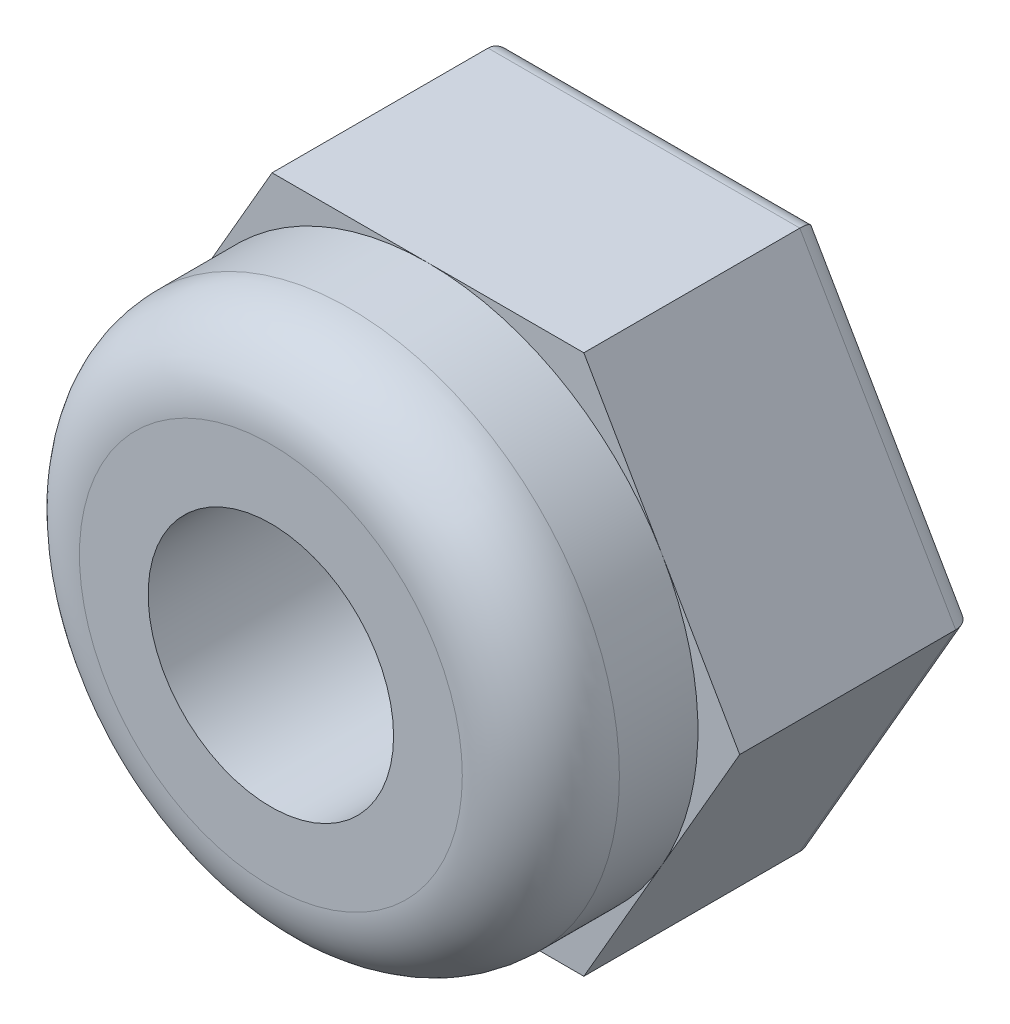
ISO-10303-21;
HEADER;
FILE_DESCRIPTION(('STEP AP214'),'2;1');
FILE_NAME('part.step','',(''),(''),'','','');
FILE_SCHEMA(('AUTOMOTIVE_DESIGN { 1 0 10303 214 1 1 1 1 }'));
ENDSEC;
DATA;
#1=APPLICATION_CONTEXT('core data for automotive mechanical design processes');
#2=APPLICATION_PROTOCOL_DEFINITION('international standard','automotive_design',2000,#1);
#3=PRODUCT_CONTEXT('',#1,'mechanical');
#4=PRODUCT('Part','Part','',(#3));
#5=PRODUCT_RELATED_PRODUCT_CATEGORY('part','',(#4));
#6=PRODUCT_DEFINITION_FORMATION('','',#4);
#7=PRODUCT_DEFINITION_CONTEXT('part definition',#1,'design');
#8=PRODUCT_DEFINITION('design','',#6,#7);
#9=PRODUCT_DEFINITION_SHAPE('','',#8);
#10=(LENGTH_UNIT() NAMED_UNIT(*) SI_UNIT(.MILLI.,.METRE.));
#11=(NAMED_UNIT(*) PLANE_ANGLE_UNIT() SI_UNIT($,.RADIAN.));
#12=(NAMED_UNIT(*) SI_UNIT($,.STERADIAN.) SOLID_ANGLE_UNIT());
#13=UNCERTAINTY_MEASURE_WITH_UNIT(LENGTH_MEASURE(1.E-05),#10,'distance_accuracy_value','');
#14=(GEOMETRIC_REPRESENTATION_CONTEXT(3) GLOBAL_UNCERTAINTY_ASSIGNED_CONTEXT((#13)) GLOBAL_UNIT_ASSIGNED_CONTEXT((#10,
#11,#12)) REPRESENTATION_CONTEXT('',''));
#15=CARTESIAN_POINT('',(0.,0.,0.));
#16=DIRECTION('',(0.,0.,1.));
#17=DIRECTION('',(1.,0.,0.));
#18=AXIS2_PLACEMENT_3D('',#15,#16,#17);
#19=CARTESIAN_POINT('',(0.,0.,2.4));
#20=DIRECTION('',(0.,0.,1.));
#21=DIRECTION('',(1.,0.,0.));
#22=AXIS2_PLACEMENT_3D('',#19,#20,#21);
#23=PLANE('',#22);
#24=CARTESIAN_POINT('',(0.,0.,2.4));
#25=DIRECTION('',(0.,0.,1.));
#26=DIRECTION('',(1.,0.,0.));
#27=AXIS2_PLACEMENT_3D('',#24,#25,#26);
#28=CIRCLE('',#27,2.75);
#29=CARTESIAN_POINT('',(2.38156986040721,1.375,2.4));
#30=VERTEX_POINT('',#29);
#31=CARTESIAN_POINT('',(0.,2.75,2.4));
#32=VERTEX_POINT('',#31);
#33=EDGE_CURVE('E150',#30,#32,#28,.T.);
#34=ORIENTED_EDGE('',*,*,#33,.F.);
#35=DIRECTION('',(-0.5,0.866025403784438,0.));
#36=VECTOR('',#35,1.);
#37=CARTESIAN_POINT('',(3.17542648054294,0.,2.4));
#38=LINE('',#37,#36);
#39=CARTESIAN_POINT('',(1.58771324027147,2.75,2.4));
#40=VERTEX_POINT('',#39);
#41=EDGE_CURVE('E137',#30,#40,#38,.T.);
#42=ORIENTED_EDGE('',*,*,#41,.T.);
#43=DIRECTION('',(-1.,0.,0.));
#44=VECTOR('',#43,1.);
#45=CARTESIAN_POINT('',(1.58771324027147,2.75,2.4));
#46=LINE('',#45,#44);
#47=EDGE_CURVE('E151',#40,#32,#46,.T.);
#48=ORIENTED_EDGE('',*,*,#47,.T.);
#49=EDGE_LOOP('',(#34,#42,#48));
#50=FACE_BOUND('',#49,.T.);
#51=ADVANCED_FACE('F35',(#50),#23,.T.);
#52=CARTESIAN_POINT('',(-2.38156986040721,1.375,2.4));
#53=VERTEX_POINT('',#52);
#54=EDGE_CURVE('E156',#32,#53,#28,.T.);
#55=ORIENTED_EDGE('',*,*,#54,.F.);
#56=CARTESIAN_POINT('',(-1.58771324027147,2.75,2.4));
#57=VERTEX_POINT('',#56);
#58=EDGE_CURVE('E136',#32,#57,#46,.T.);
#59=ORIENTED_EDGE('',*,*,#58,.T.);
#60=DIRECTION('',(-0.499999999999999,-0.866025403784439,0.));
#61=VECTOR('',#60,1.);
#62=CARTESIAN_POINT('',(-1.58771324027147,2.75,2.4));
#63=LINE('',#62,#61);
#64=EDGE_CURVE('E170',#57,#53,#63,.T.);
#65=ORIENTED_EDGE('',*,*,#64,.T.);
#66=EDGE_LOOP('',(#55,#59,#65));
#67=FACE_BOUND('',#66,.T.);
#68=ADVANCED_FACE('F252',(#67),#23,.T.);
#69=CARTESIAN_POINT('',(-2.38156986040721,-1.375,2.4));
#70=VERTEX_POINT('',#69);
#71=EDGE_CURVE('E282',#53,#70,#28,.T.);
#72=ORIENTED_EDGE('',*,*,#71,.F.);
#73=CARTESIAN_POINT('',(-3.17542648054294,0.,2.4));
#74=VERTEX_POINT('',#73);
#75=EDGE_CURVE('E169',#53,#74,#63,.T.);
#76=ORIENTED_EDGE('',*,*,#75,.T.);
#77=DIRECTION('',(0.5,-0.866025403784438,0.));
#78=VECTOR('',#77,1.);
#79=CARTESIAN_POINT('',(-3.17542648054294,0.,2.4));
#80=LINE('',#79,#78);
#81=EDGE_CURVE('E174',#74,#70,#80,.T.);
#82=ORIENTED_EDGE('',*,*,#81,.T.);
#83=EDGE_LOOP('',(#72,#76,#82));
#84=FACE_BOUND('',#83,.T.);
#85=ADVANCED_FACE('F257',(#84),#23,.T.);
#86=CARTESIAN_POINT('',(0.,-2.75,2.4));
#87=VERTEX_POINT('',#86);
#88=EDGE_CURVE('E162',#70,#87,#28,.T.);
#89=ORIENTED_EDGE('',*,*,#88,.F.);
#90=CARTESIAN_POINT('',(-1.58771324027147,-2.75,2.4));
#91=VERTEX_POINT('',#90);
#92=EDGE_CURVE('E173',#70,#91,#80,.T.);
#93=ORIENTED_EDGE('',*,*,#92,.T.);
#94=DIRECTION('',(1.,0.,0.));
#95=VECTOR('',#94,1.);
#96=CARTESIAN_POINT('',(-1.58771324027147,-2.75,2.4));
#97=LINE('',#96,#95);
#98=EDGE_CURVE('E178',#91,#87,#97,.T.);
#99=ORIENTED_EDGE('',*,*,#98,.T.);
#100=EDGE_LOOP('',(#89,#93,#99));
#101=FACE_BOUND('',#100,.T.);
#102=ADVANCED_FACE('F270',(#101),#23,.T.);
#103=CARTESIAN_POINT('',(2.38156986040721,-1.375,2.4));
#104=VERTEX_POINT('',#103);
#105=EDGE_CURVE('E160',#87,#104,#28,.T.);
#106=ORIENTED_EDGE('',*,*,#105,.F.);
#107=CARTESIAN_POINT('',(1.58771324027147,-2.75,2.4));
#108=VERTEX_POINT('',#107);
#109=EDGE_CURVE('E177',#87,#108,#97,.T.);
#110=ORIENTED_EDGE('',*,*,#109,.T.);
#111=DIRECTION('',(0.499999999999999,0.866025403784439,0.));
#112=VECTOR('',#111,1.);
#113=CARTESIAN_POINT('',(1.58771324027147,-2.75,2.4));
#114=LINE('',#113,#112);
#115=EDGE_CURVE('E148',#108,#104,#114,.T.);
#116=ORIENTED_EDGE('',*,*,#115,.T.);
#117=EDGE_LOOP('',(#106,#110,#116));
#118=FACE_BOUND('',#117,.T.);
#119=ADVANCED_FACE('F263',(#118),#23,.T.);
#120=EDGE_CURVE('E130',#104,#30,#28,.T.);
#121=ORIENTED_EDGE('',*,*,#120,.F.);
#122=CARTESIAN_POINT('',(3.17542648054294,0.,2.4));
#123=VERTEX_POINT('',#122);
#124=EDGE_CURVE('E132',#104,#123,#114,.T.);
#125=ORIENTED_EDGE('',*,*,#124,.T.);
#126=EDGE_CURVE('E126',#123,#30,#38,.T.);
#127=ORIENTED_EDGE('',*,*,#126,.T.);
#128=EDGE_LOOP('',(#121,#125,#127));
#129=FACE_BOUND('',#128,.T.);
#130=ADVANCED_FACE('F128',(#129),#23,.T.);
#131=CARTESIAN_POINT('',(0.,0.,0.));
#132=DIRECTION('',(0.,0.,1.));
#133=DIRECTION('',(1.,0.,0.));
#134=AXIS2_PLACEMENT_3D('',#131,#132,#133);
#135=PLANE('',#134);
#136=CARTESIAN_POINT('',(0.,0.,0.));
#137=DIRECTION('',(0.,0.,1.));
#138=DIRECTION('',(1.,0.,0.));
#139=AXIS2_PLACEMENT_3D('',#136,#137,#138);
#140=CIRCLE('',#139,1.45);
#141=CARTESIAN_POINT('',(1.45,0.,0.));
#142=VERTEX_POINT('',#141);
#143=EDGE_CURVE('E204',#142,#142,#140,.T.);
#144=ORIENTED_EDGE('',*,*,#143,.T.);
#145=EDGE_LOOP('',(#144));
#146=FACE_BOUND('',#145,.T.);
#147=DIRECTION('',(-1.,0.,0.));
#148=VECTOR('',#147,1.);
#149=CARTESIAN_POINT('',(0.,2.55,0.));
#150=LINE('',#149,#148);
#151=CARTESIAN_POINT('',(-1.47224318643355,2.55,0.));
#152=VERTEX_POINT('',#151);
#153=CARTESIAN_POINT('',(1.47224318643354,2.55,0.));
#154=VERTEX_POINT('',#153);
#155=EDGE_CURVE('E199',#152,#154,#150,.F.);
#156=ORIENTED_EDGE('',*,*,#155,.T.);
#157=DIRECTION('',(-0.5,0.866025403784439,0.));
#158=VECTOR('',#157,1.);
#159=CARTESIAN_POINT('',(2.20836477965032,1.275,0.));
#160=LINE('',#159,#158);
#161=CARTESIAN_POINT('',(2.94448637286709,0.,0.));
#162=VERTEX_POINT('',#161);
#163=EDGE_CURVE('E201',#154,#162,#160,.F.);
#164=ORIENTED_EDGE('',*,*,#163,.T.);
#165=DIRECTION('',(0.499999999999999,0.866025403784439,0.));
#166=VECTOR('',#165,1.);
#167=CARTESIAN_POINT('',(2.20836477965032,-1.275,0.));
#168=LINE('',#167,#166);
#169=CARTESIAN_POINT('',(1.47224318643355,-2.55,0.));
#170=VERTEX_POINT('',#169);
#171=EDGE_CURVE('E191',#162,#170,#168,.F.);
#172=ORIENTED_EDGE('',*,*,#171,.T.);
#173=DIRECTION('',(1.,0.,0.));
#174=VECTOR('',#173,1.);
#175=CARTESIAN_POINT('',(0.,-2.55,0.));
#176=LINE('',#175,#174);
#177=CARTESIAN_POINT('',(-1.47224318643354,-2.55,0.));
#178=VERTEX_POINT('',#177);
#179=EDGE_CURVE('E193',#170,#178,#176,.F.);
#180=ORIENTED_EDGE('',*,*,#179,.T.);
#181=DIRECTION('',(0.5,-0.866025403784439,0.));
#182=VECTOR('',#181,1.);
#183=CARTESIAN_POINT('',(-2.20836477965032,-1.275,0.));
#184=LINE('',#183,#182);
#185=CARTESIAN_POINT('',(-2.94448637286709,0.,0.));
#186=VERTEX_POINT('',#185);
#187=EDGE_CURVE('E195',#178,#186,#184,.F.);
#188=ORIENTED_EDGE('',*,*,#187,.T.);
#189=DIRECTION('',(-0.499999999999999,-0.866025403784439,0.));
#190=VECTOR('',#189,1.);
#191=CARTESIAN_POINT('',(-2.20836477965032,1.275,0.));
#192=LINE('',#191,#190);
#193=EDGE_CURVE('E197',#186,#152,#192,.F.);
#194=ORIENTED_EDGE('',*,*,#193,.T.);
#195=EDGE_LOOP('',(#156,#164,#172,#180,#188,#194));
#196=FACE_BOUND('',#195,.T.);
#197=ADVANCED_FACE('F262',(#146,#196),#135,.F.);
#198=CARTESIAN_POINT('',(1.58771324027147,-2.75,2.4));
#199=DIRECTION('',(-0.866025403784439,0.499999999999999,0.));
#200=DIRECTION('',(-0.499999999999999,-0.866025403784439,0.));
#201=AXIS2_PLACEMENT_3D('',#198,#199,#200);
#202=PLANE('',#201);
#203=DIRECTION('',(0.,0.,-1.));
#204=VECTOR('',#203,1.);
#205=CARTESIAN_POINT('',(1.58771324027147,-2.75,2.4));
#206=LINE('',#205,#204);
#207=CARTESIAN_POINT('',(1.58771324027147,-2.75,0.2));
#208=VERTEX_POINT('',#207);
#209=EDGE_CURVE('E181',#108,#208,#206,.T.);
#210=ORIENTED_EDGE('',*,*,#209,.T.);
#211=DIRECTION('',(0.499999999999999,0.866025403784439,0.));
#212=VECTOR('',#211,1.);
#213=CARTESIAN_POINT('',(1.58771324027147,-2.75,0.2));
#214=LINE('',#213,#212);
#215=CARTESIAN_POINT('',(3.17542648054294,0.,0.2));
#216=VERTEX_POINT('',#215);
#217=EDGE_CURVE('E218',#208,#216,#214,.T.);
#218=ORIENTED_EDGE('',*,*,#217,.T.);
#219=DIRECTION('',(0.,0.,-1.));
#220=VECTOR('',#219,1.);
#221=CARTESIAN_POINT('',(3.17542648054294,0.,2.4));
#222=LINE('',#221,#220);
#223=EDGE_CURVE('E161',#123,#216,#222,.T.);
#224=ORIENTED_EDGE('',*,*,#223,.F.);
#225=ORIENTED_EDGE('',*,*,#124,.F.);
#226=ORIENTED_EDGE('',*,*,#115,.F.);
#227=EDGE_LOOP('',(#210,#218,#224,#225,#226));
#228=FACE_BOUND('',#227,.T.);
#229=ADVANCED_FACE('F268',(#228),#202,.F.);
#230=CARTESIAN_POINT('',(3.17542648054294,0.,2.4));
#231=DIRECTION('',(-0.866025403784438,-0.5,0.));
#232=DIRECTION('',(0.5,-0.866025403784439,0.));
#233=AXIS2_PLACEMENT_3D('',#230,#231,#232);
#234=PLANE('',#233);
#235=ORIENTED_EDGE('',*,*,#223,.T.);
#236=DIRECTION('',(-0.5,0.866025403784439,0.));
#237=VECTOR('',#236,1.);
#238=CARTESIAN_POINT('',(3.17542648054294,0.,0.2));
#239=LINE('',#238,#237);
#240=CARTESIAN_POINT('',(1.58771324027147,2.75,0.2));
#241=VERTEX_POINT('',#240);
#242=EDGE_CURVE('E210',#216,#241,#239,.T.);
#243=ORIENTED_EDGE('',*,*,#242,.T.);
#244=DIRECTION('',(0.,0.,-1.));
#245=VECTOR('',#244,1.);
#246=CARTESIAN_POINT('',(1.58771324027147,2.75,2.4));
#247=LINE('',#246,#245);
#248=EDGE_CURVE('E144',#40,#241,#247,.T.);
#249=ORIENTED_EDGE('',*,*,#248,.F.);
#250=ORIENTED_EDGE('',*,*,#41,.F.);
#251=ORIENTED_EDGE('',*,*,#126,.F.);
#252=EDGE_LOOP('',(#235,#243,#249,#250,#251));
#253=FACE_BOUND('',#252,.T.);
#254=ADVANCED_FACE('F141',(#253),#234,.F.);
#255=CARTESIAN_POINT('',(1.58771324027147,2.75,2.4));
#256=DIRECTION('',(0.,-1.,0.));
#257=DIRECTION('',(1.,0.,0.));
#258=AXIS2_PLACEMENT_3D('',#255,#256,#257);
#259=PLANE('',#258);
#260=ORIENTED_EDGE('',*,*,#248,.T.);
#261=DIRECTION('',(-1.,0.,0.));
#262=VECTOR('',#261,1.);
#263=CARTESIAN_POINT('',(1.58771324027147,2.75,0.2));
#264=LINE('',#263,#262);
#265=CARTESIAN_POINT('',(-1.58771324027147,2.75,0.2));
#266=VERTEX_POINT('',#265);
#267=EDGE_CURVE('E212',#241,#266,#264,.T.);
#268=ORIENTED_EDGE('',*,*,#267,.T.);
#269=DIRECTION('',(0.,0.,-1.));
#270=VECTOR('',#269,1.);
#271=CARTESIAN_POINT('',(-1.58771324027147,2.75,2.4));
#272=LINE('',#271,#270);
#273=EDGE_CURVE('E187',#57,#266,#272,.T.);
#274=ORIENTED_EDGE('',*,*,#273,.F.);
#275=ORIENTED_EDGE('',*,*,#58,.F.);
#276=ORIENTED_EDGE('',*,*,#47,.F.);
#277=EDGE_LOOP('',(#260,#268,#274,#275,#276));
#278=FACE_BOUND('',#277,.T.);
#279=ADVANCED_FACE('F287',(#278),#259,.F.);
#280=CARTESIAN_POINT('',(-1.58771324027147,2.75,2.4));
#281=DIRECTION('',(0.866025403784439,-0.499999999999999,0.));
#282=DIRECTION('',(0.499999999999999,0.866025403784439,0.));
#283=AXIS2_PLACEMENT_3D('',#280,#281,#282);
#284=PLANE('',#283);
#285=ORIENTED_EDGE('',*,*,#273,.T.);
#286=DIRECTION('',(-0.499999999999999,-0.866025403784439,0.));
#287=VECTOR('',#286,1.);
#288=CARTESIAN_POINT('',(-1.58771324027147,2.75,0.2));
#289=LINE('',#288,#287);
#290=CARTESIAN_POINT('',(-3.17542648054294,0.,0.2));
#291=VERTEX_POINT('',#290);
#292=EDGE_CURVE('E214',#266,#291,#289,.T.);
#293=ORIENTED_EDGE('',*,*,#292,.T.);
#294=DIRECTION('',(0.,0.,-1.));
#295=VECTOR('',#294,1.);
#296=CARTESIAN_POINT('',(-3.17542648054294,0.,2.4));
#297=LINE('',#296,#295);
#298=EDGE_CURVE('E185',#74,#291,#297,.T.);
#299=ORIENTED_EDGE('',*,*,#298,.F.);
#300=ORIENTED_EDGE('',*,*,#75,.F.);
#301=ORIENTED_EDGE('',*,*,#64,.F.);
#302=EDGE_LOOP('',(#285,#293,#299,#300,#301));
#303=FACE_BOUND('',#302,.T.);
#304=ADVANCED_FACE('F292',(#303),#284,.F.);
#305=CARTESIAN_POINT('',(-3.17542648054294,0.,2.4));
#306=DIRECTION('',(0.866025403784438,0.5,0.));
#307=DIRECTION('',(-0.5,0.866025403784439,0.));
#308=AXIS2_PLACEMENT_3D('',#305,#306,#307);
#309=PLANE('',#308);
#310=ORIENTED_EDGE('',*,*,#298,.T.);
#311=DIRECTION('',(0.5,-0.866025403784439,0.));
#312=VECTOR('',#311,1.);
#313=CARTESIAN_POINT('',(-3.17542648054294,0.,0.2));
#314=LINE('',#313,#312);
#315=CARTESIAN_POINT('',(-1.58771324027147,-2.75,0.2));
#316=VERTEX_POINT('',#315);
#317=EDGE_CURVE('E58',#291,#316,#314,.T.);
#318=ORIENTED_EDGE('',*,*,#317,.T.);
#319=DIRECTION('',(0.,0.,-1.));
#320=VECTOR('',#319,1.);
#321=CARTESIAN_POINT('',(-1.58771324027147,-2.75,2.4));
#322=LINE('',#321,#320);
#323=EDGE_CURVE('E183',#91,#316,#322,.T.);
#324=ORIENTED_EDGE('',*,*,#323,.F.);
#325=ORIENTED_EDGE('',*,*,#92,.F.);
#326=ORIENTED_EDGE('',*,*,#81,.F.);
#327=EDGE_LOOP('',(#310,#318,#324,#325,#326));
#328=FACE_BOUND('',#327,.T.);
#329=ADVANCED_FACE('F296',(#328),#309,.F.);
#330=CARTESIAN_POINT('',(-1.58771324027147,-2.75,2.4));
#331=DIRECTION('',(0.,1.,0.));
#332=DIRECTION('',(-1.,0.,0.));
#333=AXIS2_PLACEMENT_3D('',#330,#331,#332);
#334=PLANE('',#333);
#335=ORIENTED_EDGE('',*,*,#323,.T.);
#336=DIRECTION('',(1.,0.,0.));
#337=VECTOR('',#336,1.);
#338=CARTESIAN_POINT('',(-1.58771324027147,-2.75,0.2));
#339=LINE('',#338,#337);
#340=EDGE_CURVE('E50',#316,#208,#339,.T.);
#341=ORIENTED_EDGE('',*,*,#340,.T.);
#342=ORIENTED_EDGE('',*,*,#209,.F.);
#343=ORIENTED_EDGE('',*,*,#109,.F.);
#344=ORIENTED_EDGE('',*,*,#98,.F.);
#345=EDGE_LOOP('',(#335,#341,#342,#343,#344));
#346=FACE_BOUND('',#345,.T.);
#347=ADVANCED_FACE('F279',(#346),#334,.F.);
#348=CARTESIAN_POINT('',(0.,0.,2.4));
#349=DIRECTION('',(0.,0.,-1.));
#350=DIRECTION('',(-1.,0.,0.));
#351=AXIS2_PLACEMENT_3D('',#348,#349,#350);
#352=CYLINDRICAL_SURFACE('',#351,1.25);
#353=CARTESIAN_POINT('',(0.,0.,0.2));
#354=DIRECTION('',(0.,0.,1.));
#355=DIRECTION('',(1.,0.,0.));
#356=AXIS2_PLACEMENT_3D('',#353,#354,#355);
#357=CIRCLE('',#356,1.25);
#358=CARTESIAN_POINT('',(1.25,0.,0.2));
#359=VERTEX_POINT('',#358);
#360=EDGE_CURVE('E207',#359,#359,#357,.F.);
#361=ORIENTED_EDGE('',*,*,#360,.T.);
#362=EDGE_LOOP('',(#361));
#363=FACE_BOUND('',#362,.T.);
#364=CARTESIAN_POINT('',(0.,0.,4.));
#365=DIRECTION('',(0.,0.,1.));
#366=DIRECTION('',(1.,0.,0.));
#367=AXIS2_PLACEMENT_3D('',#364,#365,#366);
#368=CIRCLE('',#367,1.25);
#369=CARTESIAN_POINT('',(1.25,0.,4.));
#370=VERTEX_POINT('',#369);
#371=EDGE_CURVE('E154',#370,#370,#368,.T.);
#372=ORIENTED_EDGE('',*,*,#371,.T.);
#373=EDGE_LOOP('',(#372));
#374=FACE_BOUND('',#373,.T.);
#375=ADVANCED_FACE('F366',(#363,#374),#352,.F.);
#376=CARTESIAN_POINT('',(0.,0.,4.));
#377=DIRECTION('',(0.,0.,1.));
#378=DIRECTION('',(1.,0.,0.));
#379=AXIS2_PLACEMENT_3D('',#376,#377,#378);
#380=PLANE('',#379);
#381=CARTESIAN_POINT('',(0.,0.,4.));
#382=DIRECTION('',(0.,0.,1.));
#383=DIRECTION('',(1.,0.,0.));
#384=AXIS2_PLACEMENT_3D('',#381,#382,#383);
#385=CIRCLE('',#384,1.95);
#386=CARTESIAN_POINT('',(1.95,0.,4.));
#387=VERTEX_POINT('',#386);
#388=EDGE_CURVE('E43',#387,#387,#385,.T.);
#389=ORIENTED_EDGE('',*,*,#388,.T.);
#390=EDGE_LOOP('',(#389));
#391=FACE_BOUND('',#390,.T.);
#392=ORIENTED_EDGE('',*,*,#371,.F.);
#393=EDGE_LOOP('',(#392));
#394=FACE_BOUND('',#393,.T.);
#395=ADVANCED_FACE('F238',(#391,#394),#380,.T.);
#396=CARTESIAN_POINT('',(0.,0.,4.));
#397=DIRECTION('',(0.,0.,-1.));
#398=DIRECTION('',(-1.,0.,0.));
#399=AXIS2_PLACEMENT_3D('',#396,#397,#398);
#400=CYLINDRICAL_SURFACE('',#399,2.75);
#401=CARTESIAN_POINT('',(0.,0.,3.2));
#402=DIRECTION('',(0.,0.,1.));
#403=DIRECTION('',(1.,0.,0.));
#404=AXIS2_PLACEMENT_3D('',#401,#402,#403);
#405=CIRCLE('',#404,2.75);
#406=CARTESIAN_POINT('',(2.75,0.,3.2));
#407=VERTEX_POINT('',#406);
#408=EDGE_CURVE('E11',#407,#407,#405,.F.);
#409=ORIENTED_EDGE('',*,*,#408,.T.);
#410=EDGE_LOOP('',(#409));
#411=FACE_BOUND('',#410,.T.);
#412=ORIENTED_EDGE('',*,*,#33,.T.);
#413=ORIENTED_EDGE('',*,*,#54,.T.);
#414=ORIENTED_EDGE('',*,*,#71,.T.);
#415=ORIENTED_EDGE('',*,*,#88,.T.);
#416=ORIENTED_EDGE('',*,*,#105,.T.);
#417=ORIENTED_EDGE('',*,*,#120,.T.);
#418=EDGE_LOOP('',(#412,#413,#414,#415,#416,#417));
#419=FACE_BOUND('',#418,.T.);
#420=ADVANCED_FACE('F158',(#411,#419),#400,.T.);
#421=CARTESIAN_POINT('',(0.,0.,0.2));
#422=DIRECTION('',(0.,0.,1.));
#423=DIRECTION('',(1.,0.,0.));
#424=AXIS2_PLACEMENT_3D('',#421,#422,#423);
#425=TOROIDAL_SURFACE('',#424,1.45,0.2);
#426=ORIENTED_EDGE('',*,*,#360,.F.);
#427=EDGE_LOOP('',(#426));
#428=FACE_BOUND('',#427,.T.);
#429=ORIENTED_EDGE('',*,*,#143,.F.);
#430=EDGE_LOOP('',(#429));
#431=FACE_BOUND('',#430,.T.);
#432=ADVANCED_FACE('F332',(#428,#431),#425,.T.);
#433=CARTESIAN_POINT('',(-3.00222139978605,0.0999999999999979,0.2));
#434=DIRECTION('',(0.5,-0.866025403784439,0.));
#435=DIRECTION('',(0.866025403784438,0.5,0.));
#436=AXIS2_PLACEMENT_3D('',#433,#434,#435);
#437=CYLINDRICAL_SURFACE('',#436,0.2);
#438=CARTESIAN_POINT('',(-2.94448637286709,0.,0.2));
#439=DIRECTION('',(0.,-1.,0.));
#440=DIRECTION('',(1.,0.,0.));
#441=AXIS2_PLACEMENT_3D('',#438,#439,#440);
#442=ELLIPSE('',#441,0.23094010767585,0.2);
#443=EDGE_CURVE('E230',#186,#291,#442,.F.);
#444=ORIENTED_EDGE('',*,*,#443,.F.);
#445=ORIENTED_EDGE('',*,*,#187,.F.);
#446=CARTESIAN_POINT('',(-1.47224318643354,-2.55,0.2));
#447=DIRECTION('',(0.866025403784439,-0.5,0.));
#448=DIRECTION('',(0.5,0.866025403784439,0.));
#449=AXIS2_PLACEMENT_3D('',#446,#447,#448);
#450=ELLIPSE('',#449,0.23094010767585,0.2);
#451=EDGE_CURVE('E233',#316,#178,#450,.T.);
#452=ORIENTED_EDGE('',*,*,#451,.F.);
#453=ORIENTED_EDGE('',*,*,#317,.F.);
#454=EDGE_LOOP('',(#444,#445,#452,#453));
#455=FACE_BOUND('',#454,.T.);
#456=ADVANCED_FACE('F301',(#455),#437,.T.);
#457=CARTESIAN_POINT('',(-1.58771324027147,-2.55,0.2));
#458=DIRECTION('',(1.,0.,0.));
#459=DIRECTION('',(0.,1.,0.));
#460=AXIS2_PLACEMENT_3D('',#457,#458,#459);
#461=CYLINDRICAL_SURFACE('',#460,0.2);
#462=ORIENTED_EDGE('',*,*,#451,.T.);
#463=ORIENTED_EDGE('',*,*,#179,.F.);
#464=CARTESIAN_POINT('',(1.47224318643355,-2.55,0.2));
#465=DIRECTION('',(0.866025403784438,0.5,0.));
#466=DIRECTION('',(-0.5,0.866025403784439,0.));
#467=AXIS2_PLACEMENT_3D('',#464,#465,#466);
#468=ELLIPSE('',#467,0.23094010767585,0.2);
#469=EDGE_CURVE('E227',#208,#170,#468,.T.);
#470=ORIENTED_EDGE('',*,*,#469,.F.);
#471=ORIENTED_EDGE('',*,*,#340,.F.);
#472=EDGE_LOOP('',(#462,#463,#470,#471));
#473=FACE_BOUND('',#472,.T.);
#474=ADVANCED_FACE('F305',(#473),#461,.T.);
#475=CARTESIAN_POINT('',(-1.41450815951458,2.65,0.2));
#476=DIRECTION('',(-0.499999999999999,-0.866025403784439,0.));
#477=DIRECTION('',(0.866025403784439,-0.499999999999999,0.));
#478=AXIS2_PLACEMENT_3D('',#475,#476,#477);
#479=CYLINDRICAL_SURFACE('',#478,0.2);
#480=ORIENTED_EDGE('',*,*,#443,.T.);
#481=ORIENTED_EDGE('',*,*,#292,.F.);
#482=CARTESIAN_POINT('',(-1.47224318643355,2.55,0.2));
#483=DIRECTION('',(-0.866025403784438,-0.5,0.));
#484=DIRECTION('',(0.5,-0.866025403784438,0.));
#485=AXIS2_PLACEMENT_3D('',#482,#483,#484);
#486=ELLIPSE('',#485,0.23094010767585,0.2);
#487=EDGE_CURVE('E224',#152,#266,#486,.F.);
#488=ORIENTED_EDGE('',*,*,#487,.F.);
#489=ORIENTED_EDGE('',*,*,#193,.F.);
#490=EDGE_LOOP('',(#480,#481,#488,#489));
#491=FACE_BOUND('',#490,.T.);
#492=ADVANCED_FACE('F320',(#491),#479,.T.);
#493=CARTESIAN_POINT('',(1.41450815951458,-2.65,0.2));
#494=DIRECTION('',(0.499999999999999,0.866025403784439,0.));
#495=DIRECTION('',(-0.866025403784439,0.499999999999999,0.));
#496=AXIS2_PLACEMENT_3D('',#493,#494,#495);
#497=CYLINDRICAL_SURFACE('',#496,0.2);
#498=ORIENTED_EDGE('',*,*,#469,.T.);
#499=ORIENTED_EDGE('',*,*,#171,.F.);
#500=CARTESIAN_POINT('',(2.94448637286709,0.,0.2));
#501=DIRECTION('',(0.,1.,0.));
#502=DIRECTION('',(1.,0.,0.));
#503=AXIS2_PLACEMENT_3D('',#500,#501,#502);
#504=ELLIPSE('',#503,0.23094010767585,0.2);
#505=EDGE_CURVE('E222',#216,#162,#504,.T.);
#506=ORIENTED_EDGE('',*,*,#505,.F.);
#507=ORIENTED_EDGE('',*,*,#217,.F.);
#508=EDGE_LOOP('',(#498,#499,#506,#507));
#509=FACE_BOUND('',#508,.T.);
#510=ADVANCED_FACE('F310',(#509),#497,.T.);
#511=CARTESIAN_POINT('',(1.58771324027147,2.55,0.2));
#512=DIRECTION('',(-1.,0.,0.));
#513=DIRECTION('',(0.,-1.,0.));
#514=AXIS2_PLACEMENT_3D('',#511,#512,#513);
#515=CYLINDRICAL_SURFACE('',#514,0.2);
#516=ORIENTED_EDGE('',*,*,#487,.T.);
#517=ORIENTED_EDGE('',*,*,#267,.F.);
#518=CARTESIAN_POINT('',(1.47224318643354,2.55,0.2));
#519=DIRECTION('',(-0.866025403784439,0.5,0.));
#520=DIRECTION('',(-0.5,-0.866025403784439,0.));
#521=AXIS2_PLACEMENT_3D('',#518,#519,#520);
#522=ELLIPSE('',#521,0.23094010767585,0.2);
#523=EDGE_CURVE('E220',#154,#241,#522,.F.);
#524=ORIENTED_EDGE('',*,*,#523,.F.);
#525=ORIENTED_EDGE('',*,*,#155,.F.);
#526=EDGE_LOOP('',(#516,#517,#524,#525));
#527=FACE_BOUND('',#526,.T.);
#528=ADVANCED_FACE('F247',(#527),#515,.T.);
#529=CARTESIAN_POINT('',(3.00222139978605,-0.0999999999999979,0.2));
#530=DIRECTION('',(-0.5,0.866025403784439,0.));
#531=DIRECTION('',(-0.866025403784438,-0.5,0.));
#532=AXIS2_PLACEMENT_3D('',#529,#530,#531);
#533=CYLINDRICAL_SURFACE('',#532,0.2);
#534=ORIENTED_EDGE('',*,*,#505,.T.);
#535=ORIENTED_EDGE('',*,*,#163,.F.);
#536=ORIENTED_EDGE('',*,*,#523,.T.);
#537=ORIENTED_EDGE('',*,*,#242,.F.);
#538=EDGE_LOOP('',(#534,#535,#536,#537));
#539=FACE_BOUND('',#538,.T.);
#540=ADVANCED_FACE('F242',(#539),#533,.T.);
#541=CARTESIAN_POINT('',(0.,0.,3.2));
#542=DIRECTION('',(0.,0.,1.));
#543=DIRECTION('',(1.,0.,0.));
#544=AXIS2_PLACEMENT_3D('',#541,#542,#543);
#545=TOROIDAL_SURFACE('',#544,1.95,0.8);
#546=ORIENTED_EDGE('',*,*,#408,.F.);
#547=EDGE_LOOP('',(#546));
#548=FACE_BOUND('',#547,.T.);
#549=ORIENTED_EDGE('',*,*,#388,.F.);
#550=EDGE_LOOP('',(#549));
#551=FACE_BOUND('',#550,.T.);
#552=ADVANCED_FACE('F37',(#548,#551),#545,.T.);
#553=CLOSED_SHELL('',(#51,#68,#85,#102,#119,#130,#197,#229,#254,#279,#304,#329,#347,#375,#395,
#420,#432,#456,#474,#492,#510,#528,#540,#552));
#554=MANIFOLD_SOLID_BREP('B2',#553);
#555=ADVANCED_BREP_SHAPE_REPRESENTATION('',(#18,#554),#14);
#556=SHAPE_DEFINITION_REPRESENTATION(#9,#555);
ENDSEC;
END-ISO-10303-21;
